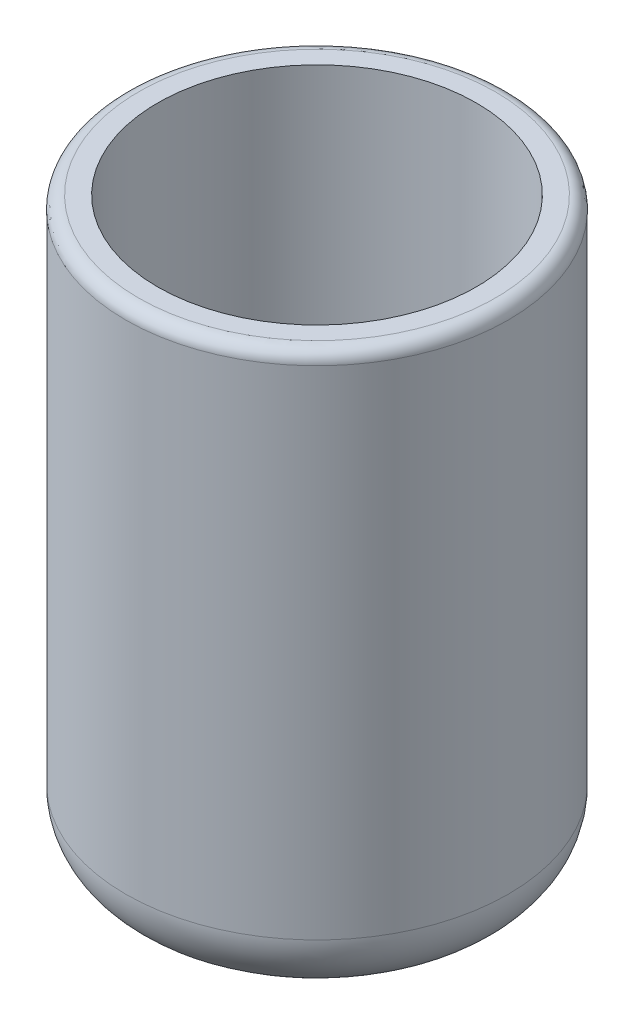
ISO-10303-21;
HEADER;
FILE_DESCRIPTION(('STEP AP214'),'2;1');
FILE_NAME('part.step','',(''),(''),'','','');
FILE_SCHEMA(('AUTOMOTIVE_DESIGN { 1 0 10303 214 1 1 1 1 }'));
ENDSEC;
DATA;
#1=APPLICATION_CONTEXT('core data for automotive mechanical design processes');
#2=APPLICATION_PROTOCOL_DEFINITION('international standard','automotive_design',2000,#1);
#3=PRODUCT_CONTEXT('',#1,'mechanical');
#4=PRODUCT('Part','Part','',(#3));
#5=PRODUCT_RELATED_PRODUCT_CATEGORY('part','',(#4));
#6=PRODUCT_DEFINITION_FORMATION('','',#4);
#7=PRODUCT_DEFINITION_CONTEXT('part definition',#1,'design');
#8=PRODUCT_DEFINITION('design','',#6,#7);
#9=PRODUCT_DEFINITION_SHAPE('','',#8);
#10=(LENGTH_UNIT() NAMED_UNIT(*) SI_UNIT(.MILLI.,.METRE.));
#11=(NAMED_UNIT(*) PLANE_ANGLE_UNIT() SI_UNIT($,.RADIAN.));
#12=(NAMED_UNIT(*) SI_UNIT($,.STERADIAN.) SOLID_ANGLE_UNIT());
#13=UNCERTAINTY_MEASURE_WITH_UNIT(LENGTH_MEASURE(1.E-05),#10,'distance_accuracy_value','');
#14=(GEOMETRIC_REPRESENTATION_CONTEXT(3) GLOBAL_UNCERTAINTY_ASSIGNED_CONTEXT((#13)) GLOBAL_UNIT_ASSIGNED_CONTEXT((#10,
#11,#12)) REPRESENTATION_CONTEXT('',''));
#15=CARTESIAN_POINT('',(0.,0.,0.));
#16=DIRECTION('',(0.,0.,1.));
#17=DIRECTION('',(1.,0.,0.));
#18=AXIS2_PLACEMENT_3D('',#15,#16,#17);
#19=CARTESIAN_POINT('',(0.,4.5,0.));
#20=DIRECTION('',(0.,-1.,0.));
#21=DIRECTION('',(0.,0.,-1.));
#22=AXIS2_PLACEMENT_3D('',#19,#20,#21);
#23=CYLINDRICAL_SURFACE('',#22,1.5);
#24=CARTESIAN_POINT('',(0.,0.5,0.));
#25=DIRECTION('',(0.,1.,0.));
#26=DIRECTION('',(0.,0.,1.));
#27=AXIS2_PLACEMENT_3D('',#24,#25,#26);
#28=CIRCLE('',#27,1.5);
#29=CARTESIAN_POINT('',(0.,0.5,1.5));
#30=VERTEX_POINT('',#29);
#31=EDGE_CURVE('E51',#30,#30,#28,.T.);
#32=ORIENTED_EDGE('',*,*,#31,.T.);
#33=EDGE_LOOP('',(#32));
#34=FACE_BOUND('',#33,.T.);
#35=CARTESIAN_POINT('',(0.,4.4,0.));
#36=DIRECTION('',(0.,1.,0.));
#37=DIRECTION('',(0.,0.,1.));
#38=AXIS2_PLACEMENT_3D('',#35,#36,#37);
#39=CIRCLE('',#38,1.5);
#40=CARTESIAN_POINT('',(0.,4.4,1.5));
#41=VERTEX_POINT('',#40);
#42=EDGE_CURVE('E56',#41,#41,#39,.F.);
#43=ORIENTED_EDGE('',*,*,#42,.T.);
#44=EDGE_LOOP('',(#43));
#45=FACE_BOUND('',#44,.T.);
#46=ADVANCED_FACE('F43',(#34,#45),#23,.T.);
#47=CARTESIAN_POINT('',(0.,4.5,0.));
#48=DIRECTION('',(0.,1.,0.));
#49=DIRECTION('',(0.,0.,1.));
#50=AXIS2_PLACEMENT_3D('',#47,#48,#49);
#51=PLANE('',#50);
#52=CARTESIAN_POINT('',(0.,4.5,0.));
#53=DIRECTION('',(0.,1.,0.));
#54=DIRECTION('',(0.,0.,1.));
#55=AXIS2_PLACEMENT_3D('',#52,#53,#54);
#56=CIRCLE('',#55,1.4);
#57=CARTESIAN_POINT('',(0.,4.5,1.4));
#58=VERTEX_POINT('',#57);
#59=EDGE_CURVE('E61',#58,#58,#56,.T.);
#60=ORIENTED_EDGE('',*,*,#59,.T.);
#61=EDGE_LOOP('',(#60));
#62=FACE_BOUND('',#61,.T.);
#63=CARTESIAN_POINT('',(0.,4.5,0.));
#64=DIRECTION('',(0.,1.,0.));
#65=DIRECTION('',(0.,0.,1.));
#66=AXIS2_PLACEMENT_3D('',#63,#64,#65);
#67=CIRCLE('',#66,1.25);
#68=CARTESIAN_POINT('',(0.,4.5,1.25));
#69=VERTEX_POINT('',#68);
#70=EDGE_CURVE('E67',#69,#69,#67,.T.);
#71=ORIENTED_EDGE('',*,*,#70,.F.);
#72=EDGE_LOOP('',(#71));
#73=FACE_BOUND('',#72,.T.);
#74=ADVANCED_FACE('F89',(#62,#73),#51,.T.);
#75=CARTESIAN_POINT('',(0.,0.,0.));
#76=DIRECTION('',(0.,1.,0.));
#77=DIRECTION('',(0.,0.,1.));
#78=AXIS2_PLACEMENT_3D('',#75,#76,#77);
#79=PLANE('',#78);
#80=CARTESIAN_POINT('',(0.,0.,0.));
#81=DIRECTION('',(0.,1.,0.));
#82=DIRECTION('',(0.,0.,1.));
#83=AXIS2_PLACEMENT_3D('',#80,#81,#82);
#84=CIRCLE('',#83,1.);
#85=CARTESIAN_POINT('',(0.,0.,1.));
#86=VERTEX_POINT('',#85);
#87=EDGE_CURVE('E10',#86,#86,#84,.F.);
#88=ORIENTED_EDGE('',*,*,#87,.T.);
#89=EDGE_LOOP('',(#88));
#90=FACE_BOUND('',#89,.T.);
#91=ADVANCED_FACE('F80',(#90),#79,.F.);
#92=CARTESIAN_POINT('',(0.,4.5,0.));
#93=DIRECTION('',(0.,-1.,0.));
#94=DIRECTION('',(0.,0.,-1.));
#95=AXIS2_PLACEMENT_3D('',#92,#93,#94);
#96=CYLINDRICAL_SURFACE('',#95,1.25);
#97=ORIENTED_EDGE('',*,*,#70,.T.);
#98=EDGE_LOOP('',(#97));
#99=FACE_BOUND('',#98,.T.);
#100=CARTESIAN_POINT('',(0.,0.25,0.));
#101=DIRECTION('',(0.,1.,0.));
#102=DIRECTION('',(0.,0.,1.));
#103=AXIS2_PLACEMENT_3D('',#100,#101,#102);
#104=CIRCLE('',#103,1.25);
#105=CARTESIAN_POINT('',(0.,0.25,1.25));
#106=VERTEX_POINT('',#105);
#107=EDGE_CURVE('E71',#106,#106,#104,.T.);
#108=ORIENTED_EDGE('',*,*,#107,.F.);
#109=EDGE_LOOP('',(#108));
#110=FACE_BOUND('',#109,.T.);
#111=ADVANCED_FACE('F78',(#99,#110),#96,.F.);
#112=CARTESIAN_POINT('',(0.,0.25,0.));
#113=DIRECTION('',(0.,1.,0.));
#114=DIRECTION('',(0.,0.,1.));
#115=AXIS2_PLACEMENT_3D('',#112,#113,#114);
#116=PLANE('',#115);
#117=ORIENTED_EDGE('',*,*,#107,.T.);
#118=EDGE_LOOP('',(#117));
#119=FACE_BOUND('',#118,.T.);
#120=ADVANCED_FACE('F76',(#119),#116,.T.);
#121=CARTESIAN_POINT('',(0.,4.4,0.));
#122=DIRECTION('',(0.,1.,0.));
#123=DIRECTION('',(0.,0.,1.));
#124=AXIS2_PLACEMENT_3D('',#121,#122,#123);
#125=TOROIDAL_SURFACE('',#124,1.4,0.1);
#126=ORIENTED_EDGE('',*,*,#42,.F.);
#127=EDGE_LOOP('',(#126));
#128=FACE_BOUND('',#127,.T.);
#129=ORIENTED_EDGE('',*,*,#59,.F.);
#130=EDGE_LOOP('',(#129));
#131=FACE_BOUND('',#130,.T.);
#132=ADVANCED_FACE('F86',(#128,#131),#125,.T.);
#133=CARTESIAN_POINT('',(0.,0.5,0.));
#134=DIRECTION('',(0.,1.,0.));
#135=DIRECTION('',(0.,0.,1.));
#136=AXIS2_PLACEMENT_3D('',#133,#134,#135);
#137=TOROIDAL_SURFACE('',#136,1.,0.5);
#138=ORIENTED_EDGE('',*,*,#87,.F.);
#139=EDGE_LOOP('',(#138));
#140=FACE_BOUND('',#139,.T.);
#141=ORIENTED_EDGE('',*,*,#31,.F.);
#142=EDGE_LOOP('',(#141));
#143=FACE_BOUND('',#142,.T.);
#144=ADVANCED_FACE('F45',(#140,#143),#137,.T.);
#145=CLOSED_SHELL('',(#46,#74,#91,#111,#120,#132,#144));
#146=MANIFOLD_SOLID_BREP('B2',#145);
#147=ADVANCED_BREP_SHAPE_REPRESENTATION('',(#18,#146),#14);
#148=SHAPE_DEFINITION_REPRESENTATION(#9,#147);
ENDSEC;
END-ISO-10303-21;
